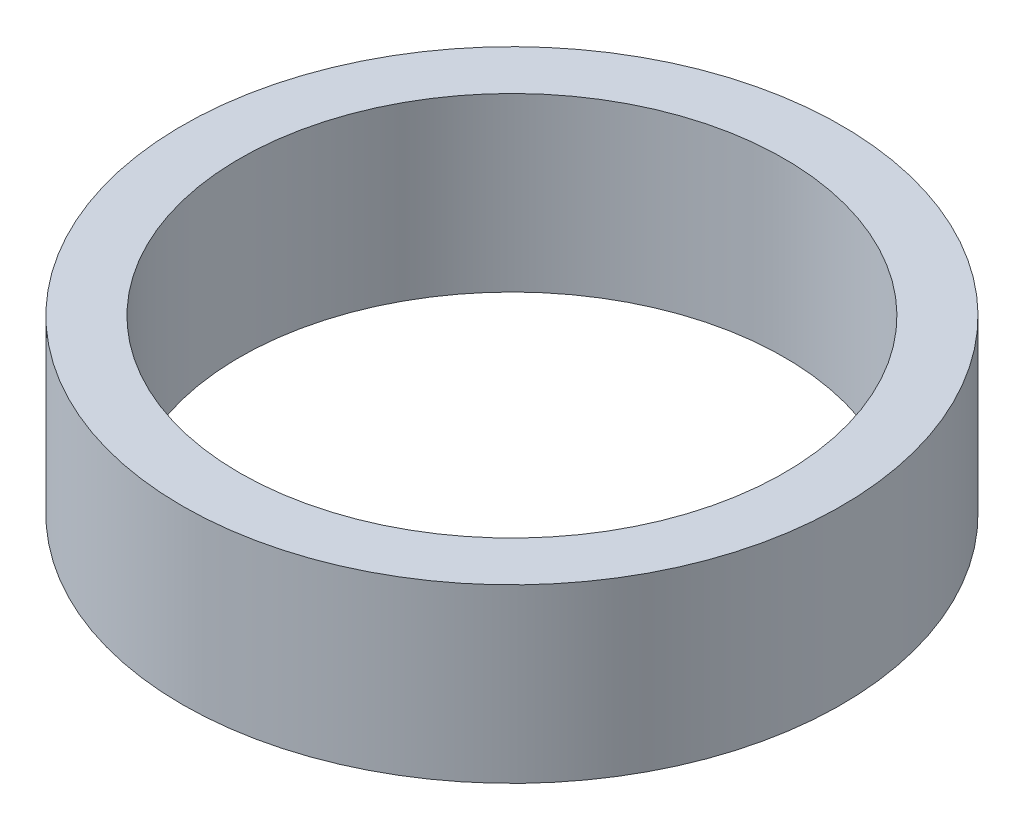
ISO-10303-21;
HEADER;
FILE_DESCRIPTION(('STEP AP214'),'2;1');
FILE_NAME('part.step','',(''),(''),'','','');
FILE_SCHEMA(('AUTOMOTIVE_DESIGN { 1 0 10303 214 1 1 1 1 }'));
ENDSEC;
DATA;
#1=APPLICATION_CONTEXT('core data for automotive mechanical design processes');
#2=APPLICATION_PROTOCOL_DEFINITION('international standard','automotive_design',2000,#1);
#3=PRODUCT_CONTEXT('',#1,'mechanical');
#4=PRODUCT('Part','Part','',(#3));
#5=PRODUCT_RELATED_PRODUCT_CATEGORY('part','',(#4));
#6=PRODUCT_DEFINITION_FORMATION('','',#4);
#7=PRODUCT_DEFINITION_CONTEXT('part definition',#1,'design');
#8=PRODUCT_DEFINITION('design','',#6,#7);
#9=PRODUCT_DEFINITION_SHAPE('','',#8);
#10=(LENGTH_UNIT() NAMED_UNIT(*) SI_UNIT(.MILLI.,.METRE.));
#11=(NAMED_UNIT(*) PLANE_ANGLE_UNIT() SI_UNIT($,.RADIAN.));
#12=(NAMED_UNIT(*) SI_UNIT($,.STERADIAN.) SOLID_ANGLE_UNIT());
#13=UNCERTAINTY_MEASURE_WITH_UNIT(LENGTH_MEASURE(1.E-05),#10,'distance_accuracy_value','');
#14=(GEOMETRIC_REPRESENTATION_CONTEXT(3) GLOBAL_UNCERTAINTY_ASSIGNED_CONTEXT((#13)) GLOBAL_UNIT_ASSIGNED_CONTEXT((#10,
#11,#12)) REPRESENTATION_CONTEXT('',''));
#15=CARTESIAN_POINT('',(0.,0.,0.));
#16=DIRECTION('',(0.,0.,1.));
#17=DIRECTION('',(1.,0.,0.));
#18=AXIS2_PLACEMENT_3D('',#15,#16,#17);
#19=CARTESIAN_POINT('',(0.,30.,0.));
#20=DIRECTION('',(0.,-1.,0.));
#21=DIRECTION('',(0.,0.,-1.));
#22=AXIS2_PLACEMENT_3D('',#19,#20,#21);
#23=CYLINDRICAL_SURFACE('',#22,57.5);
#24=CARTESIAN_POINT('',(0.,30.,0.));
#25=DIRECTION('',(0.,1.,0.));
#26=DIRECTION('',(0.,0.,1.));
#27=AXIS2_PLACEMENT_3D('',#24,#25,#26);
#28=CIRCLE('',#27,57.5);
#29=CARTESIAN_POINT('',(0.,30.,57.5));
#30=VERTEX_POINT('',#29);
#31=EDGE_CURVE('E10',#30,#30,#28,.T.);
#32=ORIENTED_EDGE('',*,*,#31,.F.);
#33=EDGE_LOOP('',(#32));
#34=FACE_BOUND('',#33,.T.);
#35=CARTESIAN_POINT('',(0.,0.,0.));
#36=DIRECTION('',(0.,1.,0.));
#37=DIRECTION('',(0.,0.,1.));
#38=AXIS2_PLACEMENT_3D('',#35,#36,#37);
#39=CIRCLE('',#38,57.5);
#40=CARTESIAN_POINT('',(0.,0.,57.5));
#41=VERTEX_POINT('',#40);
#42=EDGE_CURVE('E37',#41,#41,#39,.T.);
#43=ORIENTED_EDGE('',*,*,#42,.T.);
#44=EDGE_LOOP('',(#43));
#45=FACE_BOUND('',#44,.T.);
#46=ADVANCED_FACE('F40',(#34,#45),#23,.T.);
#47=CARTESIAN_POINT('',(0.,30.,0.));
#48=DIRECTION('',(0.,1.,0.));
#49=DIRECTION('',(0.,0.,1.));
#50=AXIS2_PLACEMENT_3D('',#47,#48,#49);
#51=PLANE('',#50);
#52=CARTESIAN_POINT('',(0.,30.,0.));
#53=DIRECTION('',(0.,1.,0.));
#54=DIRECTION('',(0.,0.,1.));
#55=AXIS2_PLACEMENT_3D('',#52,#53,#54);
#56=CIRCLE('',#55,47.5);
#57=CARTESIAN_POINT('',(0.,30.,47.5));
#58=VERTEX_POINT('',#57);
#59=EDGE_CURVE('E50',#58,#58,#56,.T.);
#60=ORIENTED_EDGE('',*,*,#59,.F.);
#61=EDGE_LOOP('',(#60));
#62=FACE_BOUND('',#61,.T.);
#63=ORIENTED_EDGE('',*,*,#31,.T.);
#64=EDGE_LOOP('',(#63));
#65=FACE_BOUND('',#64,.T.);
#66=ADVANCED_FACE('F59',(#62,#65),#51,.T.);
#67=CARTESIAN_POINT('',(0.,0.,0.));
#68=DIRECTION('',(0.,1.,0.));
#69=DIRECTION('',(0.,0.,1.));
#70=AXIS2_PLACEMENT_3D('',#67,#68,#69);
#71=PLANE('',#70);
#72=CARTESIAN_POINT('',(0.,0.,0.));
#73=DIRECTION('',(0.,1.,0.));
#74=DIRECTION('',(0.,0.,1.));
#75=AXIS2_PLACEMENT_3D('',#72,#73,#74);
#76=CIRCLE('',#75,47.5);
#77=CARTESIAN_POINT('',(0.,0.,47.5));
#78=VERTEX_POINT('',#77);
#79=EDGE_CURVE('E47',#78,#78,#76,.T.);
#80=ORIENTED_EDGE('',*,*,#79,.T.);
#81=EDGE_LOOP('',(#80));
#82=FACE_BOUND('',#81,.T.);
#83=ORIENTED_EDGE('',*,*,#42,.F.);
#84=EDGE_LOOP('',(#83));
#85=FACE_BOUND('',#84,.T.);
#86=ADVANCED_FACE('F58',(#82,#85),#71,.F.);
#87=CARTESIAN_POINT('',(0.,30.,0.));
#88=DIRECTION('',(0.,-1.,0.));
#89=DIRECTION('',(0.,0.,-1.));
#90=AXIS2_PLACEMENT_3D('',#87,#88,#89);
#91=CYLINDRICAL_SURFACE('',#90,47.5);
#92=ORIENTED_EDGE('',*,*,#59,.T.);
#93=EDGE_LOOP('',(#92));
#94=FACE_BOUND('',#93,.T.);
#95=ORIENTED_EDGE('',*,*,#79,.F.);
#96=EDGE_LOOP('',(#95));
#97=FACE_BOUND('',#96,.T.);
#98=ADVANCED_FACE('F54',(#94,#97),#91,.F.);
#99=CLOSED_SHELL('',(#46,#66,#86,#98));
#100=MANIFOLD_SOLID_BREP('B2',#99);
#101=ADVANCED_BREP_SHAPE_REPRESENTATION('',(#18,#100),#14);
#102=SHAPE_DEFINITION_REPRESENTATION(#9,#101);
ENDSEC;
END-ISO-10303-21;
